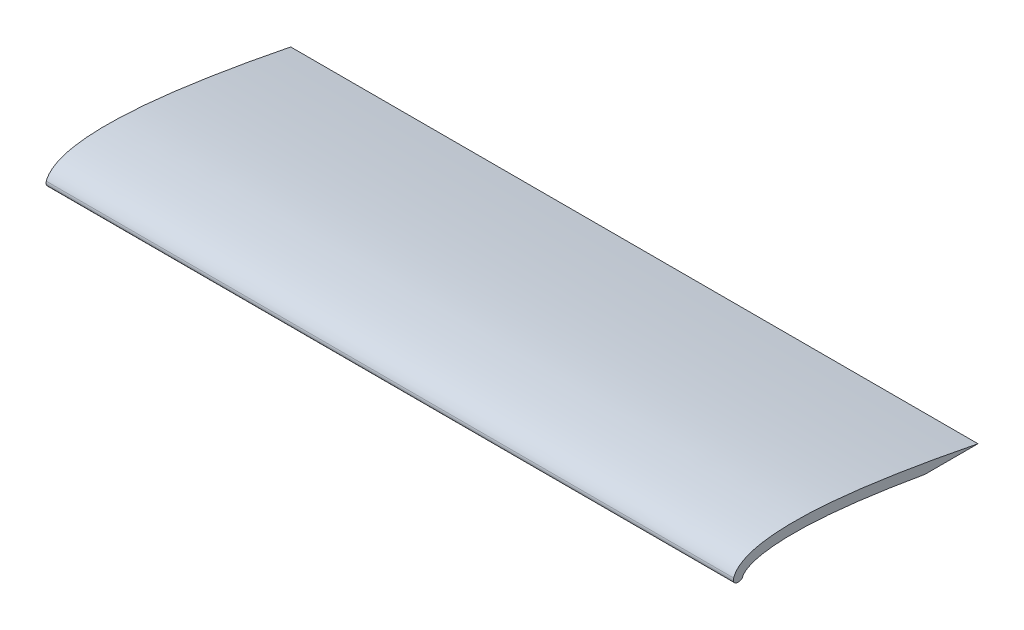
ISO-10303-21;
HEADER;
FILE_DESCRIPTION(('STEP AP214'),'2;1');
FILE_NAME('part.step','',(''),(''),'','','');
FILE_SCHEMA(('AUTOMOTIVE_DESIGN { 1 0 10303 214 1 1 1 1 }'));
ENDSEC;
DATA;
#1=APPLICATION_CONTEXT('core data for automotive mechanical design processes');
#2=APPLICATION_PROTOCOL_DEFINITION('international standard','automotive_design',2000,#1);
#3=PRODUCT_CONTEXT('',#1,'mechanical');
#4=PRODUCT('Part','Part','',(#3));
#5=PRODUCT_RELATED_PRODUCT_CATEGORY('part','',(#4));
#6=PRODUCT_DEFINITION_FORMATION('','',#4);
#7=PRODUCT_DEFINITION_CONTEXT('part definition',#1,'design');
#8=PRODUCT_DEFINITION('design','',#6,#7);
#9=PRODUCT_DEFINITION_SHAPE('','',#8);
#10=(LENGTH_UNIT() NAMED_UNIT(*) SI_UNIT(.MILLI.,.METRE.));
#11=(NAMED_UNIT(*) PLANE_ANGLE_UNIT() SI_UNIT($,.RADIAN.));
#12=(NAMED_UNIT(*) SI_UNIT($,.STERADIAN.) SOLID_ANGLE_UNIT());
#13=UNCERTAINTY_MEASURE_WITH_UNIT(LENGTH_MEASURE(1.E-05),#10,'distance_accuracy_value','');
#14=(GEOMETRIC_REPRESENTATION_CONTEXT(3) GLOBAL_UNCERTAINTY_ASSIGNED_CONTEXT((#13)) GLOBAL_UNIT_ASSIGNED_CONTEXT((#10,
#11,#12)) REPRESENTATION_CONTEXT('',''));
#15=CARTESIAN_POINT('',(0.,0.,0.));
#16=DIRECTION('',(0.,0.,1.));
#17=DIRECTION('',(1.,0.,0.));
#18=AXIS2_PLACEMENT_3D('',#15,#16,#17);
#19=CARTESIAN_POINT('',(177.8,0.,0.));
#20=DIRECTION('',(0.,1.,0.));
#21=DIRECTION('',(0.,0.,1.));
#22=AXIS2_PLACEMENT_3D('',#19,#20,#21);
#23=PLANE('',#22);
#24=DIRECTION('',(0.,0.,-1.));
#25=VECTOR('',#24,1.);
#26=CARTESIAN_POINT('',(0.,0.,0.));
#27=LINE('',#26,#25);
#28=CARTESIAN_POINT('',(0.,0.,-1.33875529825229));
#29=VERTEX_POINT('',#28);
#30=CARTESIAN_POINT('',(0.,0.,-1.61134515180446));
#31=VERTEX_POINT('',#30);
#32=EDGE_CURVE('E135',#29,#31,#27,.T.);
#33=ORIENTED_EDGE('',*,*,#32,.T.);
#34=DIRECTION('',(-1.,0.,0.));
#35=VECTOR('',#34,1.);
#36=CARTESIAN_POINT('',(177.8,0.,-1.61134515180446));
#37=LINE('',#36,#35);
#38=CARTESIAN_POINT('',(177.8,0.,-1.61134515180446));
#39=VERTEX_POINT('',#38);
#40=EDGE_CURVE('E62',#31,#39,#37,.F.);
#41=ORIENTED_EDGE('',*,*,#40,.T.);
#42=DIRECTION('',(0.,0.,-1.));
#43=VECTOR('',#42,1.);
#44=CARTESIAN_POINT('',(177.8,0.,0.));
#45=LINE('',#44,#43);
#46=CARTESIAN_POINT('',(177.8,0.,-1.33875529825229));
#47=VERTEX_POINT('',#46);
#48=EDGE_CURVE('E106',#47,#39,#45,.T.);
#49=ORIENTED_EDGE('',*,*,#48,.F.);
#50=DIRECTION('',(1.,0.,0.));
#51=VECTOR('',#50,1.);
#52=CARTESIAN_POINT('',(0.,0.,-1.33875529825229));
#53=LINE('',#52,#51);
#54=EDGE_CURVE('E155',#47,#29,#53,.F.);
#55=ORIENTED_EDGE('',*,*,#54,.T.);
#56=EDGE_LOOP('',(#33,#41,#49,#55));
#57=FACE_BOUND('',#56,.T.);
#58=ADVANCED_FACE('F40',(#57),#23,.F.);
#59=CARTESIAN_POINT('',(177.8,0.,-2.54));
#60=CARTESIAN_POINT('',(177.8,0.291970760861477,-2.54354217398631));
#61=CARTESIAN_POINT('',(177.8,0.705261198765336,-2.65290876181747));
#62=CARTESIAN_POINT('',(177.8,1.13718756902964,-2.89370011299797));
#63=CARTESIAN_POINT('',(177.8,1.74977015305522,-3.56704572606773));
#64=CARTESIAN_POINT('',(177.8,2.41317953169404,-4.8349085178923));
#65=CARTESIAN_POINT('',(177.8,3.00450629799207,-6.72016171009383));
#66=CARTESIAN_POINT('',(177.8,3.5702768056388,-9.81450284228064));
#67=CARTESIAN_POINT('',(177.8,3.90630750763399,-15.6113038242882));
#68=CARTESIAN_POINT('',(177.8,3.51988253455658,-24.3457886379911));
#69=CARTESIAN_POINT('',(177.8,1.4622820431344,-43.219981025716));
#70=CARTESIAN_POINT('',(177.8,-2.49067491625494,-63.001865016749));
#71=B_SPLINE_CURVE_WITH_KNOTS('',2,(#59,#60,#61,#62,#63,#64,#65,#66,#67,#68,#69,#70),
.UNSPECIFIED.,.F.,.F.,(3,1,1,1,1,1,1,1,1,1,3),(0.,0.046875,0.09375,0.15625,0.21875,0.28125,
0.34375,0.4375,0.5625,0.6875,1.),.UNSPECIFIED.);
#72=DIRECTION('',(-1.,0.,0.));
#73=VECTOR('',#72,1.);
#74=SURFACE_OF_LINEAR_EXTRUSION('',#71,#73);
#75=CARTESIAN_POINT('',(177.8,0.709329567180042,-2.66887952746217));
#76=VERTEX_POINT('',#75);
#77=CARTESIAN_POINT('',(177.8,0.,-49.7677114483254));
#78=VERTEX_POINT('',#77);
#79=EDGE_CURVE('E95',#76,#78,#71,.T.);
#80=ORIENTED_EDGE('',*,*,#79,.F.);
#81=DIRECTION('',(-1.,0.,0.));
#82=VECTOR('',#81,1.);
#83=CARTESIAN_POINT('',(177.8,0.709329567180042,-2.66887952746217));
#84=LINE('',#83,#82);
#85=CARTESIAN_POINT('',(0.,0.709329567180042,-2.66887952746217));
#86=VERTEX_POINT('',#85);
#87=EDGE_CURVE('E117',#76,#86,#84,.T.);
#88=ORIENTED_EDGE('',*,*,#87,.T.);
#89=CARTESIAN_POINT('',(0.,0.,-2.54));
#90=CARTESIAN_POINT('',(0.,0.291970760861477,-2.54354217398631));
#91=CARTESIAN_POINT('',(0.,0.705261198765336,-2.65290876181747));
#92=CARTESIAN_POINT('',(0.,1.13718756902964,-2.89370011299797));
#93=CARTESIAN_POINT('',(0.,1.74977015305522,-3.56704572606773));
#94=CARTESIAN_POINT('',(0.,2.41317953169404,-4.8349085178923));
#95=CARTESIAN_POINT('',(0.,3.00450629799207,-6.72016171009383));
#96=CARTESIAN_POINT('',(0.,3.5702768056388,-9.81450284228064));
#97=CARTESIAN_POINT('',(0.,3.90630750763399,-15.6113038242882));
#98=CARTESIAN_POINT('',(0.,3.51988253455658,-24.3457886379911));
#99=CARTESIAN_POINT('',(0.,1.4622820431344,-43.219981025716));
#100=CARTESIAN_POINT('',(0.,-2.49067491625494,-63.001865016749));
#101=B_SPLINE_CURVE_WITH_KNOTS('',2,(#89,#90,#91,#92,#93,#94,#95,#96,#97,#98,#99,#100),
.UNSPECIFIED.,.F.,.F.,(3,1,1,1,1,1,1,1,1,1,3),(0.,0.046875,0.09375,0.15625,0.21875,0.28125,
0.34375,0.4375,0.5625,0.6875,1.),.UNSPECIFIED.);
#102=CARTESIAN_POINT('',(0.,0.,-49.7677114483254));
#103=VERTEX_POINT('',#102);
#104=EDGE_CURVE('E112',#86,#103,#101,.T.);
#105=ORIENTED_EDGE('',*,*,#104,.T.);
#106=DIRECTION('',(-1.,0.,0.));
#107=VECTOR('',#106,1.);
#108=CARTESIAN_POINT('',(177.8,0.,-49.7677114483254));
#109=LINE('',#108,#107);
#110=EDGE_CURVE('E109',#78,#103,#109,.T.);
#111=ORIENTED_EDGE('',*,*,#110,.F.);
#112=EDGE_LOOP('',(#80,#88,#105,#111));
#113=FACE_BOUND('',#112,.T.);
#114=ADVANCED_FACE('F110',(#113),#74,.F.);
#115=CARTESIAN_POINT('',(0.,0.,-63.5));
#116=VERTEX_POINT('',#115);
#117=EDGE_CURVE('E130',#103,#116,#27,.T.);
#118=ORIENTED_EDGE('',*,*,#117,.T.);
#119=DIRECTION('',(-1.,0.,0.));
#120=VECTOR('',#119,1.);
#121=CARTESIAN_POINT('',(177.8,0.,-63.5));
#122=LINE('',#121,#120);
#123=CARTESIAN_POINT('',(177.8,0.,-63.5));
#124=VERTEX_POINT('',#123);
#125=EDGE_CURVE('E118',#124,#116,#122,.T.);
#126=ORIENTED_EDGE('',*,*,#125,.F.);
#127=EDGE_CURVE('E99',#78,#124,#45,.T.);
#128=ORIENTED_EDGE('',*,*,#127,.F.);
#129=ORIENTED_EDGE('',*,*,#110,.T.);
#130=EDGE_LOOP('',(#118,#126,#128,#129));
#131=FACE_BOUND('',#130,.T.);
#132=ADVANCED_FACE('F120',(#131),#23,.F.);
#133=CARTESIAN_POINT('',(177.8,0.,0.));
#134=CARTESIAN_POINT('',(177.8,12.7,0.));
#135=CARTESIAN_POINT('',(177.8,0.,-63.5));
#136=B_SPLINE_CURVE_WITH_KNOTS('',2,(#133,#134,#135),.UNSPECIFIED.,.F.,.F.,(3,3),(0.,1.),.UNSPECIFIED.);
#137=DIRECTION('',(-1.,0.,0.));
#138=VECTOR('',#137,1.);
#139=SURFACE_OF_LINEAR_EXTRUSION('',#136,#138);
#140=CARTESIAN_POINT('',(0.,0.,0.));
#141=CARTESIAN_POINT('',(0.,12.7,0.));
#142=CARTESIAN_POINT('',(0.,0.,-63.5));
#143=B_SPLINE_CURVE_WITH_KNOTS('',2,(#140,#141,#142),.UNSPECIFIED.,.F.,.F.,(3,3),(0.,1.),.UNSPECIFIED.);
#144=CARTESIAN_POINT('',(0.,1.54271163961233,-0.267924029957224));
#145=VERTEX_POINT('',#144);
#146=EDGE_CURVE('E128',#145,#116,#143,.T.);
#147=ORIENTED_EDGE('',*,*,#146,.F.);
#148=DIRECTION('',(-1.,0.,0.));
#149=VECTOR('',#148,1.);
#150=CARTESIAN_POINT('',(0.,1.54271163962548,-0.267924029962135));
#151=LINE('',#150,#149);
#152=CARTESIAN_POINT('',(177.8,1.54271163961233,-0.267924029957224));
#153=VERTEX_POINT('',#152);
#154=EDGE_CURVE('E11',#145,#153,#151,.F.);
#155=ORIENTED_EDGE('',*,*,#154,.T.);
#156=EDGE_CURVE('E123',#153,#124,#136,.T.);
#157=ORIENTED_EDGE('',*,*,#156,.T.);
#158=ORIENTED_EDGE('',*,*,#125,.T.);
#159=EDGE_LOOP('',(#147,#155,#157,#158));
#160=FACE_BOUND('',#159,.T.);
#161=ADVANCED_FACE('F169',(#160),#139,.T.);
#162=CARTESIAN_POINT('',(177.8,0.,0.));
#163=DIRECTION('',(1.,0.,0.));
#164=DIRECTION('',(0.,0.,-1.));
#165=AXIS2_PLACEMENT_3D('',#162,#163,#164);
#166=PLANE('',#165);
#167=ORIENTED_EDGE('',*,*,#48,.T.);
#168=CARTESIAN_POINT('',(177.8,1.143,-1.61134515180446));
#169=DIRECTION('',(1.,0.,0.));
#170=DIRECTION('',(0.,0.,-1.));
#171=AXIS2_PLACEMENT_3D('',#168,#169,#170);
#172=CIRCLE('',#171,1.143);
#173=EDGE_CURVE('E49',#39,#76,#172,.T.);
#174=ORIENTED_EDGE('',*,*,#173,.T.);
#175=ORIENTED_EDGE('',*,*,#79,.T.);
#176=ORIENTED_EDGE('',*,*,#127,.T.);
#177=ORIENTED_EDGE('',*,*,#156,.F.);
#178=CARTESIAN_POINT('',(177.8,1.143,-1.33875529825229));
#179=DIRECTION('',(1.,0.,0.));
#180=DIRECTION('',(0.,0.,-1.));
#181=AXIS2_PLACEMENT_3D('',#178,#179,#180);
#182=CIRCLE('',#181,1.143);
#183=EDGE_CURVE('E161',#153,#47,#182,.T.);
#184=ORIENTED_EDGE('',*,*,#183,.T.);
#185=EDGE_LOOP('',(#167,#174,#175,#176,#177,#184));
#186=FACE_BOUND('',#185,.T.);
#187=ADVANCED_FACE('F97',(#186),#166,.T.);
#188=CARTESIAN_POINT('',(0.,0.,0.));
#189=DIRECTION('',(1.,0.,0.));
#190=DIRECTION('',(0.,0.,-1.));
#191=AXIS2_PLACEMENT_3D('',#188,#189,#190);
#192=PLANE('',#191);
#193=ORIENTED_EDGE('',*,*,#104,.F.);
#194=CARTESIAN_POINT('',(0.,1.143,-1.61134515180446));
#195=DIRECTION('',(1.,0.,0.));
#196=DIRECTION('',(0.,0.,-1.));
#197=AXIS2_PLACEMENT_3D('',#194,#195,#196);
#198=CIRCLE('',#197,1.143);
#199=EDGE_CURVE('E152',#86,#31,#198,.F.);
#200=ORIENTED_EDGE('',*,*,#199,.T.);
#201=ORIENTED_EDGE('',*,*,#32,.F.);
#202=CARTESIAN_POINT('',(0.,1.143,-1.33875529825229));
#203=DIRECTION('',(1.,0.,0.));
#204=DIRECTION('',(0.,0.,-1.));
#205=AXIS2_PLACEMENT_3D('',#202,#203,#204);
#206=CIRCLE('',#205,1.143);
#207=EDGE_CURVE('E149',#29,#145,#206,.F.);
#208=ORIENTED_EDGE('',*,*,#207,.T.);
#209=ORIENTED_EDGE('',*,*,#146,.T.);
#210=ORIENTED_EDGE('',*,*,#117,.F.);
#211=EDGE_LOOP('',(#193,#200,#201,#208,#209,#210));
#212=FACE_BOUND('',#211,.T.);
#213=ADVANCED_FACE('F168',(#212),#192,.F.);
#214=CARTESIAN_POINT('',(88.8999999999999,1.143,-1.61134515180446));
#215=DIRECTION('',(-1.,0.,0.));
#216=DIRECTION('',(0.,0.,1.));
#217=AXIS2_PLACEMENT_3D('',#214,#215,#216);
#218=CYLINDRICAL_SURFACE('',#217,1.143);
#219=ORIENTED_EDGE('',*,*,#173,.F.);
#220=ORIENTED_EDGE('',*,*,#40,.F.);
#221=ORIENTED_EDGE('',*,*,#199,.F.);
#222=ORIENTED_EDGE('',*,*,#87,.F.);
#223=EDGE_LOOP('',(#219,#220,#221,#222));
#224=FACE_BOUND('',#223,.T.);
#225=ADVANCED_FACE('F189',(#224),#218,.T.);
#226=CARTESIAN_POINT('',(88.9,1.143,-1.33875529825229));
#227=DIRECTION('',(-1.,0.,0.));
#228=DIRECTION('',(0.,0.,1.));
#229=AXIS2_PLACEMENT_3D('',#226,#227,#228);
#230=CYLINDRICAL_SURFACE('',#229,1.143);
#231=ORIENTED_EDGE('',*,*,#183,.F.);
#232=ORIENTED_EDGE('',*,*,#154,.F.);
#233=ORIENTED_EDGE('',*,*,#207,.F.);
#234=ORIENTED_EDGE('',*,*,#54,.F.);
#235=EDGE_LOOP('',(#231,#232,#233,#234));
#236=FACE_BOUND('',#235,.T.);
#237=ADVANCED_FACE('F42',(#236),#230,.T.);
#238=CLOSED_SHELL('',(#58,#114,#132,#161,#187,#213,#225,#237));
#239=MANIFOLD_SOLID_BREP('B2',#238);
#240=ADVANCED_BREP_SHAPE_REPRESENTATION('',(#18,#239),#14);
#241=SHAPE_DEFINITION_REPRESENTATION(#9,#240);
ENDSEC;
END-ISO-10303-21;
